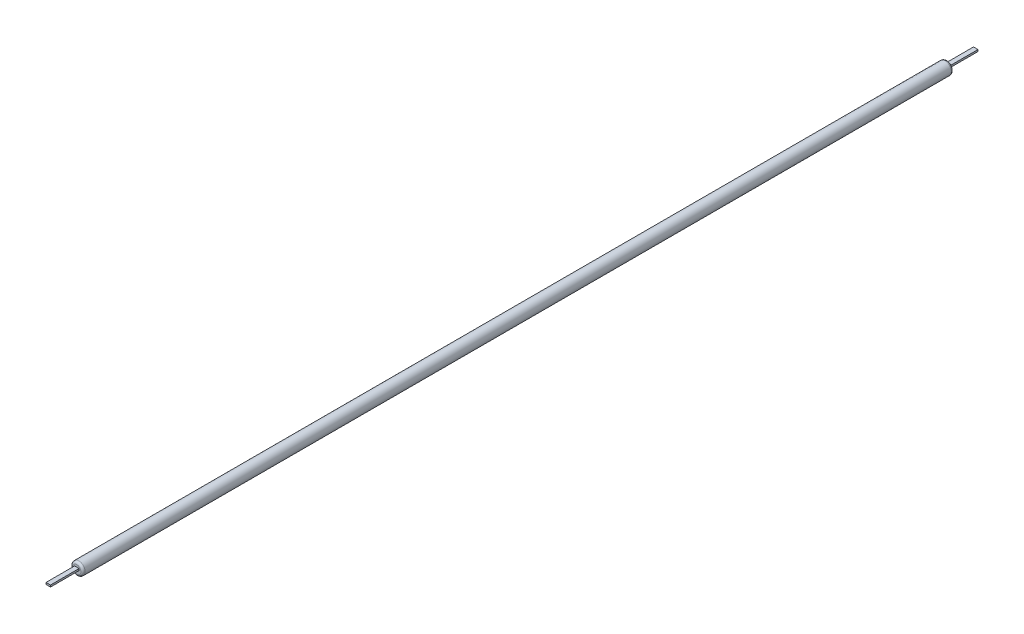
ISO-10303-21;
HEADER;
FILE_DESCRIPTION(('STEP AP214'),'2;1');
FILE_NAME('part.step','',(''),(''),'','','');
FILE_SCHEMA(('AUTOMOTIVE_DESIGN { 1 0 10303 214 1 1 1 1 }'));
ENDSEC;
DATA;
#1=APPLICATION_CONTEXT('core data for automotive mechanical design processes');
#2=APPLICATION_PROTOCOL_DEFINITION('international standard','automotive_design',2000,#1);
#3=PRODUCT_CONTEXT('',#1,'mechanical');
#4=PRODUCT('Part','Part','',(#3));
#5=PRODUCT_RELATED_PRODUCT_CATEGORY('part','',(#4));
#6=PRODUCT_DEFINITION_FORMATION('','',#4);
#7=PRODUCT_DEFINITION_CONTEXT('part definition',#1,'design');
#8=PRODUCT_DEFINITION('design','',#6,#7);
#9=PRODUCT_DEFINITION_SHAPE('','',#8);
#10=(LENGTH_UNIT() NAMED_UNIT(*) SI_UNIT(.MILLI.,.METRE.));
#11=(NAMED_UNIT(*) PLANE_ANGLE_UNIT() SI_UNIT($,.RADIAN.));
#12=(NAMED_UNIT(*) SI_UNIT($,.STERADIAN.) SOLID_ANGLE_UNIT());
#13=UNCERTAINTY_MEASURE_WITH_UNIT(LENGTH_MEASURE(1.E-05),#10,'distance_accuracy_value','');
#14=(GEOMETRIC_REPRESENTATION_CONTEXT(3) GLOBAL_UNCERTAINTY_ASSIGNED_CONTEXT((#13)) GLOBAL_UNIT_ASSIGNED_CONTEXT((#10,
#11,#12)) REPRESENTATION_CONTEXT('',''));
#15=CARTESIAN_POINT('',(0.,0.,0.));
#16=DIRECTION('',(0.,0.,1.));
#17=DIRECTION('',(1.,0.,0.));
#18=AXIS2_PLACEMENT_3D('',#15,#16,#17);
#19=CARTESIAN_POINT('',(0.,0.,0.));
#20=DIRECTION('',(0.,-1.,0.));
#21=DIRECTION('',(0.,0.,-1.));
#22=AXIS2_PLACEMENT_3D('',#19,#20,#21);
#23=PLANE('',#22);
#24=DIRECTION('',(1.,0.,0.));
#25=VECTOR('',#24,1.);
#26=CARTESIAN_POINT('',(0.,0.,0.));
#27=LINE('',#26,#25);
#28=CARTESIAN_POINT('',(-0.314851495323452,0.,0.));
#29=VERTEX_POINT('',#28);
#30=CARTESIAN_POINT('',(0.314851495323452,0.,0.));
#31=VERTEX_POINT('',#30);
#32=EDGE_CURVE('E454',#29,#31,#27,.T.);
#33=ORIENTED_EDGE('',*,*,#32,.F.);
#34=DIRECTION('',(0.,0.,1.));
#35=VECTOR('',#34,1.);
#36=CARTESIAN_POINT('',(-0.314851495323452,0.,4.));
#37=LINE('',#36,#35);
#38=CARTESIAN_POINT('',(-0.314851495323452,0.,-4.));
#39=VERTEX_POINT('',#38);
#40=EDGE_CURVE('E224',#39,#29,#37,.T.);
#41=ORIENTED_EDGE('',*,*,#40,.F.);
#42=DIRECTION('',(-1.,0.,0.));
#43=VECTOR('',#42,1.);
#44=CARTESIAN_POINT('',(-0.314851495323452,0.,-4.));
#45=LINE('',#44,#43);
#46=CARTESIAN_POINT('',(0.314851495323452,0.,-4.));
#47=VERTEX_POINT('',#46);
#48=EDGE_CURVE('E232',#47,#39,#45,.T.);
#49=ORIENTED_EDGE('',*,*,#48,.F.);
#50=DIRECTION('',(0.,0.,-1.));
#51=VECTOR('',#50,1.);
#52=CARTESIAN_POINT('',(0.314851495323452,0.,4.));
#53=LINE('',#52,#51);
#54=EDGE_CURVE('E220',#31,#47,#53,.T.);
#55=ORIENTED_EDGE('',*,*,#54,.F.);
#56=EDGE_LOOP('',(#33,#41,#49,#55));
#57=FACE_BOUND('',#56,.T.);
#58=DIRECTION('',(0.,0.,1.));
#59=VECTOR('',#58,1.);
#60=CARTESIAN_POINT('',(-0.17116827667545,0.,-3.03330056295761));
#61=LINE('',#60,#59);
#62=CARTESIAN_POINT('',(-0.17116827667545,0.,-3.03330056295761));
#63=VERTEX_POINT('',#62);
#64=CARTESIAN_POINT('',(-0.17116827667545,0.,-2.98842876808582));
#65=VERTEX_POINT('',#64);
#66=EDGE_CURVE('E190',#63,#65,#61,.T.);
#67=ORIENTED_EDGE('',*,*,#66,.T.);
#68=DIRECTION('',(1.,0.,0.));
#69=VECTOR('',#68,1.);
#70=CARTESIAN_POINT('',(-0.17116827667545,0.,-2.98842876808582));
#71=LINE('',#70,#69);
#72=CARTESIAN_POINT('',(-0.0237323792395522,0.,-2.98842876808582));
#73=VERTEX_POINT('',#72);
#74=EDGE_CURVE('E52',#65,#73,#71,.T.);
#75=ORIENTED_EDGE('',*,*,#74,.T.);
#76=DIRECTION('',(0.,0.,1.));
#77=VECTOR('',#76,1.);
#78=CARTESIAN_POINT('',(-0.0237323792395522,0.,-2.98842876808582));
#79=LINE('',#78,#77);
#80=CARTESIAN_POINT('',(-0.0237323792395522,0.,-2.84099287064992));
#81=VERTEX_POINT('',#80);
#82=EDGE_CURVE('E194',#73,#81,#79,.T.);
#83=ORIENTED_EDGE('',*,*,#82,.T.);
#84=DIRECTION('',(1.,0.,0.));
#85=VECTOR('',#84,1.);
#86=CARTESIAN_POINT('',(-0.0237323792395522,0.,-2.84099287064992));
#87=LINE('',#86,#85);
#88=CARTESIAN_POINT('',(0.0211394156322427,0.,-2.84099287064992));
#89=VERTEX_POINT('',#88);
#90=EDGE_CURVE('E272',#81,#89,#87,.T.);
#91=ORIENTED_EDGE('',*,*,#90,.T.);
#92=DIRECTION('',(0.,0.,-1.));
#93=VECTOR('',#92,1.);
#94=CARTESIAN_POINT('',(0.0211394156322427,0.,-2.84099287064992));
#95=LINE('',#94,#93);
#96=CARTESIAN_POINT('',(0.0211394156322427,0.,-2.98842876808582));
#97=VERTEX_POINT('',#96);
#98=EDGE_CURVE('E275',#89,#97,#95,.T.);
#99=ORIENTED_EDGE('',*,*,#98,.T.);
#100=DIRECTION('',(1.,0.,0.));
#101=VECTOR('',#100,1.);
#102=CARTESIAN_POINT('',(0.0211394156322427,0.,-2.98842876808582));
#103=LINE('',#102,#101);
#104=CARTESIAN_POINT('',(0.16857531306814,0.,-2.98842876808582));
#105=VERTEX_POINT('',#104);
#106=EDGE_CURVE('E281',#97,#105,#103,.T.);
#107=ORIENTED_EDGE('',*,*,#106,.T.);
#108=DIRECTION('',(0.,0.,-1.));
#109=VECTOR('',#108,1.);
#110=CARTESIAN_POINT('',(0.16857531306814,0.,-2.98842876808582));
#111=LINE('',#110,#109);
#112=CARTESIAN_POINT('',(0.16857531306814,0.,-3.03330056295761));
#113=VERTEX_POINT('',#112);
#114=EDGE_CURVE('E296',#105,#113,#111,.T.);
#115=ORIENTED_EDGE('',*,*,#114,.T.);
#116=DIRECTION('',(-1.,0.,0.));
#117=VECTOR('',#116,1.);
#118=CARTESIAN_POINT('',(0.16857531306814,0.,-3.03330056295761));
#119=LINE('',#118,#117);
#120=CARTESIAN_POINT('',(0.0211394156322427,0.,-3.03330056295761));
#121=VERTEX_POINT('',#120);
#122=EDGE_CURVE('E300',#113,#121,#119,.T.);
#123=ORIENTED_EDGE('',*,*,#122,.T.);
#124=DIRECTION('',(0.,0.,-1.));
#125=VECTOR('',#124,1.);
#126=CARTESIAN_POINT('',(0.0211394156322427,0.,-3.03330056295761));
#127=LINE('',#126,#125);
#128=CARTESIAN_POINT('',(0.0211394156322427,0.,-3.18073646039351));
#129=VERTEX_POINT('',#128);
#130=EDGE_CURVE('E304',#121,#129,#127,.T.);
#131=ORIENTED_EDGE('',*,*,#130,.T.);
#132=DIRECTION('',(-1.,0.,0.));
#133=VECTOR('',#132,1.);
#134=CARTESIAN_POINT('',(0.0211394156322427,0.,-3.18073646039351));
#135=LINE('',#134,#133);
#136=CARTESIAN_POINT('',(-0.0237323792395522,0.,-3.18073646039351));
#137=VERTEX_POINT('',#136);
#138=EDGE_CURVE('E309',#129,#137,#135,.T.);
#139=ORIENTED_EDGE('',*,*,#138,.T.);
#140=DIRECTION('',(0.,0.,1.));
#141=VECTOR('',#140,1.);
#142=CARTESIAN_POINT('',(-0.0237323792395522,0.,-3.18073646039351));
#143=LINE('',#142,#141);
#144=CARTESIAN_POINT('',(-0.0237323792395522,0.,-3.03330056295761));
#145=VERTEX_POINT('',#144);
#146=EDGE_CURVE('E312',#137,#145,#143,.T.);
#147=ORIENTED_EDGE('',*,*,#146,.T.);
#148=DIRECTION('',(-1.,0.,0.));
#149=VECTOR('',#148,1.);
#150=CARTESIAN_POINT('',(-0.0237323792395522,0.,-3.03330056295761));
#151=LINE('',#150,#149);
#152=EDGE_CURVE('E246',#145,#63,#151,.T.);
#153=ORIENTED_EDGE('',*,*,#152,.T.);
#154=EDGE_LOOP('',(#67,#75,#83,#91,#99,#107,#115,#123,#131,#139,#147,#153));
#155=FACE_BOUND('',#154,.T.);
#156=ADVANCED_FACE('F37',(#57,#155),#23,.T.);
#157=CARTESIAN_POINT('',(0.,0.,0.));
#158=DIRECTION('',(0.,0.,1.));
#159=DIRECTION('',(1.,0.,0.));
#160=AXIS2_PLACEMENT_3D('',#157,#158,#159);
#161=PLANE('',#160);
#162=CARTESIAN_POINT('',(0.,0.,0.));
#163=DIRECTION('',(0.,0.,1.));
#164=DIRECTION('',(1.,0.,0.));
#165=AXIS2_PLACEMENT_3D('',#162,#163,#164);
#166=CIRCLE('',#165,0.575);
#167=CARTESIAN_POINT('',(0.575,0.,0.));
#168=VERTEX_POINT('',#167);
#169=EDGE_CURVE('E45',#168,#168,#166,.F.);
#170=ORIENTED_EDGE('',*,*,#169,.T.);
#171=EDGE_LOOP('',(#170));
#172=FACE_BOUND('',#171,.T.);
#173=DIRECTION('',(1.,0.,0.));
#174=VECTOR('',#173,1.);
#175=CARTESIAN_POINT('',(0.,0.25,0.));
#176=LINE('',#175,#174);
#177=CARTESIAN_POINT('',(-0.314851495323452,0.25,0.));
#178=VERTEX_POINT('',#177);
#179=CARTESIAN_POINT('',(0.314851495323452,0.25,0.));
#180=VERTEX_POINT('',#179);
#181=EDGE_CURVE('E447',#178,#180,#176,.T.);
#182=ORIENTED_EDGE('',*,*,#181,.F.);
#183=DIRECTION('',(0.,1.,0.));
#184=VECTOR('',#183,1.);
#185=CARTESIAN_POINT('',(-0.314851495323452,0.,0.));
#186=LINE('',#185,#184);
#187=EDGE_CURVE('E452',#29,#178,#186,.T.);
#188=ORIENTED_EDGE('',*,*,#187,.F.);
#189=ORIENTED_EDGE('',*,*,#32,.T.);
#190=DIRECTION('',(0.,-1.,0.));
#191=VECTOR('',#190,1.);
#192=CARTESIAN_POINT('',(0.314851495323452,0.,0.));
#193=LINE('',#192,#191);
#194=EDGE_CURVE('E449',#180,#31,#193,.T.);
#195=ORIENTED_EDGE('',*,*,#194,.F.);
#196=EDGE_LOOP('',(#182,#188,#189,#195));
#197=FACE_BOUND('',#196,.T.);
#198=ADVANCED_FACE('F382',(#172,#197),#161,.F.);
#199=CARTESIAN_POINT('',(0.,0.,122.));
#200=DIRECTION('',(0.,0.,-1.));
#201=DIRECTION('',(-1.,0.,0.));
#202=AXIS2_PLACEMENT_3D('',#199,#200,#201);
#203=CYLINDRICAL_SURFACE('',#202,0.875);
#204=CARTESIAN_POINT('',(0.,0.,0.299999999999981));
#205=DIRECTION('',(0.,0.,1.));
#206=DIRECTION('',(1.,0.,0.));
#207=AXIS2_PLACEMENT_3D('',#204,#205,#206);
#208=CIRCLE('',#207,0.875);
#209=CARTESIAN_POINT('',(0.875,0.,0.299999999999981));
#210=VERTEX_POINT('',#209);
#211=EDGE_CURVE('E430',#210,#210,#208,.T.);
#212=ORIENTED_EDGE('',*,*,#211,.T.);
#213=EDGE_LOOP('',(#212));
#214=FACE_BOUND('',#213,.T.);
#215=CARTESIAN_POINT('',(0.,0.,121.7));
#216=DIRECTION('',(0.,0.,1.));
#217=DIRECTION('',(1.,0.,0.));
#218=AXIS2_PLACEMENT_3D('',#215,#216,#217);
#219=CIRCLE('',#218,0.875);
#220=CARTESIAN_POINT('',(0.875,0.,121.7));
#221=VERTEX_POINT('',#220);
#222=EDGE_CURVE('E431',#221,#221,#219,.F.);
#223=ORIENTED_EDGE('',*,*,#222,.T.);
#224=EDGE_LOOP('',(#223));
#225=FACE_BOUND('',#224,.T.);
#226=ADVANCED_FACE('F388',(#214,#225),#203,.T.);
#227=CARTESIAN_POINT('',(0.,0.,122.));
#228=DIRECTION('',(0.,0.,1.));
#229=DIRECTION('',(1.,0.,0.));
#230=AXIS2_PLACEMENT_3D('',#227,#228,#229);
#231=PLANE('',#230);
#232=CARTESIAN_POINT('',(0.,0.,122.));
#233=DIRECTION('',(0.,0.,1.));
#234=DIRECTION('',(1.,0.,0.));
#235=AXIS2_PLACEMENT_3D('',#232,#233,#234);
#236=CIRCLE('',#235,0.575);
#237=CARTESIAN_POINT('',(0.575,0.,122.));
#238=VERTEX_POINT('',#237);
#239=EDGE_CURVE('E12',#238,#238,#236,.T.);
#240=ORIENTED_EDGE('',*,*,#239,.T.);
#241=EDGE_LOOP('',(#240));
#242=FACE_BOUND('',#241,.T.);
#243=DIRECTION('',(-1.,0.,0.));
#244=VECTOR('',#243,1.);
#245=CARTESIAN_POINT('',(0.,0.25,122.));
#246=LINE('',#245,#244);
#247=CARTESIAN_POINT('',(0.314851495323457,0.25,122.));
#248=VERTEX_POINT('',#247);
#249=CARTESIAN_POINT('',(-0.314851495323447,0.25,122.));
#250=VERTEX_POINT('',#249);
#251=EDGE_CURVE('E434',#248,#250,#246,.T.);
#252=ORIENTED_EDGE('',*,*,#251,.F.);
#253=DIRECTION('',(0.,-1.,0.));
#254=VECTOR('',#253,1.);
#255=CARTESIAN_POINT('',(0.314851495323457,0.,122.));
#256=LINE('',#255,#254);
#257=CARTESIAN_POINT('',(0.314851495323457,0.,122.));
#258=VERTEX_POINT('',#257);
#259=EDGE_CURVE('E438',#248,#258,#256,.T.);
#260=ORIENTED_EDGE('',*,*,#259,.T.);
#261=DIRECTION('',(-1.,0.,0.));
#262=VECTOR('',#261,1.);
#263=CARTESIAN_POINT('',(0.,0.,122.));
#264=LINE('',#263,#262);
#265=CARTESIAN_POINT('',(-0.314851495323448,0.,122.));
#266=VERTEX_POINT('',#265);
#267=EDGE_CURVE('E444',#258,#266,#264,.T.);
#268=ORIENTED_EDGE('',*,*,#267,.T.);
#269=DIRECTION('',(0.,1.,0.));
#270=VECTOR('',#269,1.);
#271=CARTESIAN_POINT('',(-0.314851495323447,0.,122.));
#272=LINE('',#271,#270);
#273=EDGE_CURVE('E441',#266,#250,#272,.T.);
#274=ORIENTED_EDGE('',*,*,#273,.T.);
#275=EDGE_LOOP('',(#252,#260,#268,#274));
#276=FACE_BOUND('',#275,.T.);
#277=ADVANCED_FACE('F407',(#242,#276),#231,.T.);
#278=CARTESIAN_POINT('',(0.314851495323452,0.25,4.));
#279=DIRECTION('',(-1.,0.,0.));
#280=DIRECTION('',(0.,0.,1.));
#281=AXIS2_PLACEMENT_3D('',#278,#279,#280);
#282=PLANE('',#281);
#283=DIRECTION('',(0.,0.,-1.));
#284=VECTOR('',#283,1.);
#285=CARTESIAN_POINT('',(0.314851495323452,0.25,4.));
#286=LINE('',#285,#284);
#287=CARTESIAN_POINT('',(0.314851495323452,0.25,-4.));
#288=VERTEX_POINT('',#287);
#289=EDGE_CURVE('E221',#180,#288,#286,.T.);
#290=ORIENTED_EDGE('',*,*,#289,.F.);
#291=ORIENTED_EDGE('',*,*,#194,.T.);
#292=ORIENTED_EDGE('',*,*,#54,.T.);
#293=DIRECTION('',(0.,-1.,0.));
#294=VECTOR('',#293,1.);
#295=CARTESIAN_POINT('',(0.314851495323452,0.25,-4.));
#296=LINE('',#295,#294);
#297=EDGE_CURVE('E458',#288,#47,#296,.T.);
#298=ORIENTED_EDGE('',*,*,#297,.F.);
#299=EDGE_LOOP('',(#290,#291,#292,#298));
#300=FACE_BOUND('',#299,.T.);
#301=ADVANCED_FACE('F398',(#300),#282,.F.);
#302=CARTESIAN_POINT('',(-0.314851495323452,0.25,4.));
#303=DIRECTION('',(1.,0.,0.));
#304=DIRECTION('',(0.,0.,-1.));
#305=AXIS2_PLACEMENT_3D('',#302,#303,#304);
#306=PLANE('',#305);
#307=ORIENTED_EDGE('',*,*,#40,.T.);
#308=ORIENTED_EDGE('',*,*,#187,.T.);
#309=DIRECTION('',(0.,0.,1.));
#310=VECTOR('',#309,1.);
#311=CARTESIAN_POINT('',(-0.314851495323452,0.25,4.));
#312=LINE('',#311,#310);
#313=CARTESIAN_POINT('',(-0.314851495323452,0.25,-4.));
#314=VERTEX_POINT('',#313);
#315=EDGE_CURVE('E226',#314,#178,#312,.T.);
#316=ORIENTED_EDGE('',*,*,#315,.F.);
#317=DIRECTION('',(0.,-1.,0.));
#318=VECTOR('',#317,1.);
#319=CARTESIAN_POINT('',(-0.314851495323452,0.25,-4.));
#320=LINE('',#319,#318);
#321=EDGE_CURVE('E229',#314,#39,#320,.T.);
#322=ORIENTED_EDGE('',*,*,#321,.T.);
#323=EDGE_LOOP('',(#307,#308,#316,#322));
#324=FACE_BOUND('',#323,.T.);
#325=ADVANCED_FACE('F395',(#324),#306,.F.);
#326=CARTESIAN_POINT('',(0.,0.25,0.));
#327=DIRECTION('',(0.,-1.,0.));
#328=DIRECTION('',(0.,0.,-1.));
#329=AXIS2_PLACEMENT_3D('',#326,#327,#328);
#330=PLANE('',#329);
#331=ORIENTED_EDGE('',*,*,#315,.T.);
#332=ORIENTED_EDGE('',*,*,#181,.T.);
#333=ORIENTED_EDGE('',*,*,#289,.T.);
#334=DIRECTION('',(-1.,0.,0.));
#335=VECTOR('',#334,1.);
#336=CARTESIAN_POINT('',(-0.314851495323452,0.25,-4.));
#337=LINE('',#336,#335);
#338=EDGE_CURVE('E223',#288,#314,#337,.T.);
#339=ORIENTED_EDGE('',*,*,#338,.T.);
#340=EDGE_LOOP('',(#331,#332,#333,#339));
#341=FACE_BOUND('',#340,.T.);
#342=ADVANCED_FACE('F393',(#341),#330,.F.);
#343=CARTESIAN_POINT('',(-0.314851495323452,0.25,-4.));
#344=DIRECTION('',(0.,0.,1.));
#345=DIRECTION('',(1.,0.,0.));
#346=AXIS2_PLACEMENT_3D('',#343,#344,#345);
#347=PLANE('',#346);
#348=ORIENTED_EDGE('',*,*,#48,.T.);
#349=ORIENTED_EDGE('',*,*,#321,.F.);
#350=ORIENTED_EDGE('',*,*,#338,.F.);
#351=ORIENTED_EDGE('',*,*,#297,.T.);
#352=EDGE_LOOP('',(#348,#349,#350,#351));
#353=FACE_BOUND('',#352,.T.);
#354=ADVANCED_FACE('F400',(#353),#347,.F.);
#355=CARTESIAN_POINT('',(0.314851495323457,0.25,118.));
#356=DIRECTION('',(-1.,0.,0.));
#357=DIRECTION('',(0.,0.,1.));
#358=AXIS2_PLACEMENT_3D('',#355,#356,#357);
#359=PLANE('',#358);
#360=ORIENTED_EDGE('',*,*,#259,.F.);
#361=DIRECTION('',(0.,0.,-1.));
#362=VECTOR('',#361,1.);
#363=CARTESIAN_POINT('',(0.314851495323457,0.25,118.));
#364=LINE('',#363,#362);
#365=CARTESIAN_POINT('',(0.314851495323458,0.25,126.));
#366=VERTEX_POINT('',#365);
#367=EDGE_CURVE('E204',#366,#248,#364,.T.);
#368=ORIENTED_EDGE('',*,*,#367,.F.);
#369=DIRECTION('',(0.,-1.,0.));
#370=VECTOR('',#369,1.);
#371=CARTESIAN_POINT('',(0.314851495323458,0.25,126.));
#372=LINE('',#371,#370);
#373=CARTESIAN_POINT('',(0.314851495323458,0.,126.));
#374=VERTEX_POINT('',#373);
#375=EDGE_CURVE('E211',#366,#374,#372,.T.);
#376=ORIENTED_EDGE('',*,*,#375,.T.);
#377=DIRECTION('',(0.,0.,-1.));
#378=VECTOR('',#377,1.);
#379=CARTESIAN_POINT('',(0.314851495323457,0.,118.));
#380=LINE('',#379,#378);
#381=EDGE_CURVE('E195',#374,#258,#380,.T.);
#382=ORIENTED_EDGE('',*,*,#381,.T.);
#383=EDGE_LOOP('',(#360,#368,#376,#382));
#384=FACE_BOUND('',#383,.T.);
#385=ADVANCED_FACE('F403',(#384),#359,.F.);
#386=CARTESIAN_POINT('',(-0.314851495323448,0.25,118.));
#387=DIRECTION('',(1.,0.,0.));
#388=DIRECTION('',(0.,0.,-1.));
#389=AXIS2_PLACEMENT_3D('',#386,#387,#388);
#390=PLANE('',#389);
#391=ORIENTED_EDGE('',*,*,#273,.F.);
#392=DIRECTION('',(0.,0.,1.));
#393=VECTOR('',#392,1.);
#394=CARTESIAN_POINT('',(-0.314851495323448,0.,118.));
#395=LINE('',#394,#393);
#396=CARTESIAN_POINT('',(-0.314851495323447,0.,126.));
#397=VERTEX_POINT('',#396);
#398=EDGE_CURVE('E60',#266,#397,#395,.T.);
#399=ORIENTED_EDGE('',*,*,#398,.T.);
#400=DIRECTION('',(0.,-1.,0.));
#401=VECTOR('',#400,1.);
#402=CARTESIAN_POINT('',(-0.314851495323447,0.25,126.));
#403=LINE('',#402,#401);
#404=CARTESIAN_POINT('',(-0.314851495323447,0.25,126.));
#405=VERTEX_POINT('',#404);
#406=EDGE_CURVE('E217',#405,#397,#403,.T.);
#407=ORIENTED_EDGE('',*,*,#406,.F.);
#408=DIRECTION('',(0.,0.,1.));
#409=VECTOR('',#408,1.);
#410=CARTESIAN_POINT('',(-0.314851495323448,0.25,118.));
#411=LINE('',#410,#409);
#412=EDGE_CURVE('E207',#250,#405,#411,.T.);
#413=ORIENTED_EDGE('',*,*,#412,.F.);
#414=EDGE_LOOP('',(#391,#399,#407,#413));
#415=FACE_BOUND('',#414,.T.);
#416=ADVANCED_FACE('F492',(#415),#390,.F.);
#417=CARTESIAN_POINT('',(-0.314851495323447,0.25,126.));
#418=DIRECTION('',(0.,0.,-1.));
#419=DIRECTION('',(-1.,0.,0.));
#420=AXIS2_PLACEMENT_3D('',#417,#418,#419);
#421=PLANE('',#420);
#422=DIRECTION('',(1.,0.,0.));
#423=VECTOR('',#422,1.);
#424=CARTESIAN_POINT('',(-0.314851495323447,0.,126.));
#425=LINE('',#424,#423);
#426=EDGE_CURVE('E208',#397,#374,#425,.T.);
#427=ORIENTED_EDGE('',*,*,#426,.T.);
#428=ORIENTED_EDGE('',*,*,#375,.F.);
#429=DIRECTION('',(1.,0.,0.));
#430=VECTOR('',#429,1.);
#431=CARTESIAN_POINT('',(-0.314851495323447,0.25,126.));
#432=LINE('',#431,#430);
#433=EDGE_CURVE('E210',#405,#366,#432,.T.);
#434=ORIENTED_EDGE('',*,*,#433,.F.);
#435=ORIENTED_EDGE('',*,*,#406,.T.);
#436=EDGE_LOOP('',(#427,#428,#434,#435));
#437=FACE_BOUND('',#436,.T.);
#438=ADVANCED_FACE('F499',(#437),#421,.F.);
#439=CARTESIAN_POINT('',(0.,0.25,0.));
#440=DIRECTION('',(0.,1.,0.));
#441=DIRECTION('',(0.,0.,1.));
#442=AXIS2_PLACEMENT_3D('',#439,#440,#441);
#443=PLANE('',#442);
#444=ORIENTED_EDGE('',*,*,#367,.T.);
#445=ORIENTED_EDGE('',*,*,#251,.T.);
#446=ORIENTED_EDGE('',*,*,#412,.T.);
#447=ORIENTED_EDGE('',*,*,#433,.T.);
#448=EDGE_LOOP('',(#444,#445,#446,#447));
#449=FACE_BOUND('',#448,.T.);
#450=ADVANCED_FACE('F423',(#449),#443,.T.);
#451=CARTESIAN_POINT('',(0.,0.,0.));
#452=DIRECTION('',(0.,1.,0.));
#453=DIRECTION('',(0.,0.,1.));
#454=AXIS2_PLACEMENT_3D('',#451,#452,#453);
#455=PLANE('',#454);
#456=ORIENTED_EDGE('',*,*,#267,.F.);
#457=ORIENTED_EDGE('',*,*,#381,.F.);
#458=ORIENTED_EDGE('',*,*,#426,.F.);
#459=ORIENTED_EDGE('',*,*,#398,.F.);
#460=EDGE_LOOP('',(#456,#457,#458,#459));
#461=FACE_BOUND('',#460,.T.);
#462=ADVANCED_FACE('F416',(#461),#455,.F.);
#463=CARTESIAN_POINT('',(0.,0.,0.299999999999995));
#464=DIRECTION('',(0.,0.,1.));
#465=DIRECTION('',(1.,0.,0.));
#466=AXIS2_PLACEMENT_3D('',#463,#464,#465);
#467=TOROIDAL_SURFACE('',#466,0.575,0.3);
#468=ORIENTED_EDGE('',*,*,#169,.F.);
#469=EDGE_LOOP('',(#468));
#470=FACE_BOUND('',#469,.T.);
#471=ORIENTED_EDGE('',*,*,#211,.F.);
#472=EDGE_LOOP('',(#471));
#473=FACE_BOUND('',#472,.T.);
#474=ADVANCED_FACE('F414',(#470,#473),#467,.T.);
#475=CARTESIAN_POINT('',(0.,0.,121.7));
#476=DIRECTION('',(0.,0.,1.));
#477=DIRECTION('',(1.,0.,0.));
#478=AXIS2_PLACEMENT_3D('',#475,#476,#477);
#479=TOROIDAL_SURFACE('',#478,0.575,0.3);
#480=ORIENTED_EDGE('',*,*,#222,.F.);
#481=EDGE_LOOP('',(#480));
#482=FACE_BOUND('',#481,.T.);
#483=ORIENTED_EDGE('',*,*,#239,.F.);
#484=EDGE_LOOP('',(#483));
#485=FACE_BOUND('',#484,.T.);
#486=ADVANCED_FACE('F39',(#482,#485),#479,.T.);
#487=CARTESIAN_POINT('',(-0.17116827667545,0.06,-2.98842876808582));
#488=DIRECTION('',(0.,0.,-1.));
#489=DIRECTION('',(-1.,0.,0.));
#490=AXIS2_PLACEMENT_3D('',#487,#488,#489);
#491=PLANE('',#490);
#492=ORIENTED_EDGE('',*,*,#74,.F.);
#493=DIRECTION('',(0.,-1.,0.));
#494=VECTOR('',#493,1.);
#495=CARTESIAN_POINT('',(-0.17116827667545,0.06,-2.98842876808582));
#496=LINE('',#495,#494);
#497=CARTESIAN_POINT('',(-0.17116827667545,0.06,-2.98842876808582));
#498=VERTEX_POINT('',#497);
#499=EDGE_CURVE('E189',#498,#65,#496,.T.);
#500=ORIENTED_EDGE('',*,*,#499,.F.);
#501=DIRECTION('',(1.,0.,0.));
#502=VECTOR('',#501,1.);
#503=CARTESIAN_POINT('',(-0.17116827667545,0.06,-2.98842876808582));
#504=LINE('',#503,#502);
#505=CARTESIAN_POINT('',(-0.0237323792395522,0.06,-2.98842876808582));
#506=VERTEX_POINT('',#505);
#507=EDGE_CURVE('E180',#498,#506,#504,.T.);
#508=ORIENTED_EDGE('',*,*,#507,.T.);
#509=DIRECTION('',(0.,-1.,0.));
#510=VECTOR('',#509,1.);
#511=CARTESIAN_POINT('',(-0.0237323792395522,0.06,-2.98842876808582));
#512=LINE('',#511,#510);
#513=EDGE_CURVE('E188',#506,#73,#512,.T.);
#514=ORIENTED_EDGE('',*,*,#513,.T.);
#515=EDGE_LOOP('',(#492,#500,#508,#514));
#516=FACE_BOUND('',#515,.T.);
#517=ADVANCED_FACE('F187',(#516),#491,.T.);
#518=CARTESIAN_POINT('',(-0.0237323792395522,0.06,-2.98842876808582));
#519=DIRECTION('',(1.,0.,0.));
#520=DIRECTION('',(0.,0.,-1.));
#521=AXIS2_PLACEMENT_3D('',#518,#519,#520);
#522=PLANE('',#521);
#523=ORIENTED_EDGE('',*,*,#82,.F.);
#524=ORIENTED_EDGE('',*,*,#513,.F.);
#525=DIRECTION('',(0.,0.,1.));
#526=VECTOR('',#525,1.);
#527=CARTESIAN_POINT('',(-0.0237323792395522,0.06,-2.98842876808582));
#528=LINE('',#527,#526);
#529=CARTESIAN_POINT('',(-0.0237323792395522,0.06,-2.84099287064992));
#530=VERTEX_POINT('',#529);
#531=EDGE_CURVE('E176',#506,#530,#528,.T.);
#532=ORIENTED_EDGE('',*,*,#531,.T.);
#533=DIRECTION('',(0.,-1.,0.));
#534=VECTOR('',#533,1.);
#535=CARTESIAN_POINT('',(-0.0237323792395522,0.06,-2.84099287064992));
#536=LINE('',#535,#534);
#537=EDGE_CURVE('E196',#530,#81,#536,.T.);
#538=ORIENTED_EDGE('',*,*,#537,.T.);
#539=EDGE_LOOP('',(#523,#524,#532,#538));
#540=FACE_BOUND('',#539,.T.);
#541=ADVANCED_FACE('F192',(#540),#522,.T.);
#542=CARTESIAN_POINT('',(-0.0237323792395522,0.06,-2.84099287064992));
#543=DIRECTION('',(0.,0.,-1.));
#544=DIRECTION('',(-1.,0.,0.));
#545=AXIS2_PLACEMENT_3D('',#542,#543,#544);
#546=PLANE('',#545);
#547=ORIENTED_EDGE('',*,*,#90,.F.);
#548=ORIENTED_EDGE('',*,*,#537,.F.);
#549=DIRECTION('',(1.,0.,0.));
#550=VECTOR('',#549,1.);
#551=CARTESIAN_POINT('',(-0.0237323792395522,0.06,-2.84099287064992));
#552=LINE('',#551,#550);
#553=CARTESIAN_POINT('',(0.0211394156322427,0.06,-2.84099287064992));
#554=VERTEX_POINT('',#553);
#555=EDGE_CURVE('E182',#530,#554,#552,.T.);
#556=ORIENTED_EDGE('',*,*,#555,.T.);
#557=DIRECTION('',(0.,-1.,0.));
#558=VECTOR('',#557,1.);
#559=CARTESIAN_POINT('',(0.0211394156322427,0.06,-2.84099287064992));
#560=LINE('',#559,#558);
#561=EDGE_CURVE('E200',#554,#89,#560,.T.);
#562=ORIENTED_EDGE('',*,*,#561,.T.);
#563=EDGE_LOOP('',(#547,#548,#556,#562));
#564=FACE_BOUND('',#563,.T.);
#565=ADVANCED_FACE('F270',(#564),#546,.T.);
#566=CARTESIAN_POINT('',(0.0211394156322427,0.06,-2.84099287064992));
#567=DIRECTION('',(-1.,0.,0.));
#568=DIRECTION('',(0.,0.,1.));
#569=AXIS2_PLACEMENT_3D('',#566,#567,#568);
#570=PLANE('',#569);
#571=ORIENTED_EDGE('',*,*,#98,.F.);
#572=ORIENTED_EDGE('',*,*,#561,.F.);
#573=DIRECTION('',(0.,0.,-1.));
#574=VECTOR('',#573,1.);
#575=CARTESIAN_POINT('',(0.0211394156322427,0.06,-2.84099287064992));
#576=LINE('',#575,#574);
#577=CARTESIAN_POINT('',(0.0211394156322427,0.06,-2.98842876808582));
#578=VERTEX_POINT('',#577);
#579=EDGE_CURVE('E343',#554,#578,#576,.T.);
#580=ORIENTED_EDGE('',*,*,#579,.T.);
#581=DIRECTION('',(0.,-1.,0.));
#582=VECTOR('',#581,1.);
#583=CARTESIAN_POINT('',(0.0211394156322427,0.06,-2.98842876808582));
#584=LINE('',#583,#582);
#585=EDGE_CURVE('E265',#578,#97,#584,.T.);
#586=ORIENTED_EDGE('',*,*,#585,.T.);
#587=EDGE_LOOP('',(#571,#572,#580,#586));
#588=FACE_BOUND('',#587,.T.);
#589=ADVANCED_FACE('F276',(#588),#570,.T.);
#590=CARTESIAN_POINT('',(0.0211394156322427,0.06,-2.98842876808582));
#591=DIRECTION('',(0.,0.,-1.));
#592=DIRECTION('',(-1.,0.,0.));
#593=AXIS2_PLACEMENT_3D('',#590,#591,#592);
#594=PLANE('',#593);
#595=ORIENTED_EDGE('',*,*,#106,.F.);
#596=ORIENTED_EDGE('',*,*,#585,.F.);
#597=DIRECTION('',(1.,0.,0.));
#598=VECTOR('',#597,1.);
#599=CARTESIAN_POINT('',(0.0211394156322427,0.06,-2.98842876808582));
#600=LINE('',#599,#598);
#601=CARTESIAN_POINT('',(0.16857531306814,0.06,-2.98842876808582));
#602=VERTEX_POINT('',#601);
#603=EDGE_CURVE('E341',#578,#602,#600,.T.);
#604=ORIENTED_EDGE('',*,*,#603,.T.);
#605=DIRECTION('',(0.,-1.,0.));
#606=VECTOR('',#605,1.);
#607=CARTESIAN_POINT('',(0.16857531306814,0.06,-2.98842876808582));
#608=LINE('',#607,#606);
#609=EDGE_CURVE('E263',#602,#105,#608,.T.);
#610=ORIENTED_EDGE('',*,*,#609,.T.);
#611=EDGE_LOOP('',(#595,#596,#604,#610));
#612=FACE_BOUND('',#611,.T.);
#613=ADVANCED_FACE('F347',(#612),#594,.T.);
#614=CARTESIAN_POINT('',(0.16857531306814,0.06,-2.98842876808582));
#615=DIRECTION('',(-1.,0.,0.));
#616=DIRECTION('',(0.,0.,1.));
#617=AXIS2_PLACEMENT_3D('',#614,#615,#616);
#618=PLANE('',#617);
#619=ORIENTED_EDGE('',*,*,#114,.F.);
#620=ORIENTED_EDGE('',*,*,#609,.F.);
#621=DIRECTION('',(0.,0.,-1.));
#622=VECTOR('',#621,1.);
#623=CARTESIAN_POINT('',(0.16857531306814,0.06,-2.98842876808582));
#624=LINE('',#623,#622);
#625=CARTESIAN_POINT('',(0.16857531306814,0.06,-3.03330056295761));
#626=VERTEX_POINT('',#625);
#627=EDGE_CURVE('E339',#602,#626,#624,.T.);
#628=ORIENTED_EDGE('',*,*,#627,.T.);
#629=DIRECTION('',(0.,-1.,0.));
#630=VECTOR('',#629,1.);
#631=CARTESIAN_POINT('',(0.16857531306814,0.06,-3.03330056295761));
#632=LINE('',#631,#630);
#633=EDGE_CURVE('E261',#626,#113,#632,.T.);
#634=ORIENTED_EDGE('',*,*,#633,.T.);
#635=EDGE_LOOP('',(#619,#620,#628,#634));
#636=FACE_BOUND('',#635,.T.);
#637=ADVANCED_FACE('F355',(#636),#618,.T.);
#638=CARTESIAN_POINT('',(0.16857531306814,0.06,-3.03330056295761));
#639=DIRECTION('',(0.,0.,1.));
#640=DIRECTION('',(1.,0.,0.));
#641=AXIS2_PLACEMENT_3D('',#638,#639,#640);
#642=PLANE('',#641);
#643=ORIENTED_EDGE('',*,*,#122,.F.);
#644=ORIENTED_EDGE('',*,*,#633,.F.);
#645=DIRECTION('',(-1.,0.,0.));
#646=VECTOR('',#645,1.);
#647=CARTESIAN_POINT('',(0.16857531306814,0.06,-3.03330056295761));
#648=LINE('',#647,#646);
#649=CARTESIAN_POINT('',(0.0211394156322427,0.06,-3.03330056295761));
#650=VERTEX_POINT('',#649);
#651=EDGE_CURVE('E337',#626,#650,#648,.T.);
#652=ORIENTED_EDGE('',*,*,#651,.T.);
#653=DIRECTION('',(0.,-1.,0.));
#654=VECTOR('',#653,1.);
#655=CARTESIAN_POINT('',(0.0211394156322427,0.06,-3.03330056295761));
#656=LINE('',#655,#654);
#657=EDGE_CURVE('E259',#650,#121,#656,.T.);
#658=ORIENTED_EDGE('',*,*,#657,.T.);
#659=EDGE_LOOP('',(#643,#644,#652,#658));
#660=FACE_BOUND('',#659,.T.);
#661=ADVANCED_FACE('F358',(#660),#642,.T.);
#662=CARTESIAN_POINT('',(0.0211394156322427,0.06,-3.03330056295761));
#663=DIRECTION('',(-1.,0.,0.));
#664=DIRECTION('',(0.,0.,1.));
#665=AXIS2_PLACEMENT_3D('',#662,#663,#664);
#666=PLANE('',#665);
#667=ORIENTED_EDGE('',*,*,#130,.F.);
#668=ORIENTED_EDGE('',*,*,#657,.F.);
#669=DIRECTION('',(0.,0.,-1.));
#670=VECTOR('',#669,1.);
#671=CARTESIAN_POINT('',(0.0211394156322427,0.06,-3.03330056295761));
#672=LINE('',#671,#670);
#673=CARTESIAN_POINT('',(0.0211394156322427,0.06,-3.18073646039351));
#674=VERTEX_POINT('',#673);
#675=EDGE_CURVE('E335',#650,#674,#672,.T.);
#676=ORIENTED_EDGE('',*,*,#675,.T.);
#677=DIRECTION('',(0.,-1.,0.));
#678=VECTOR('',#677,1.);
#679=CARTESIAN_POINT('',(0.0211394156322427,0.06,-3.18073646039351));
#680=LINE('',#679,#678);
#681=EDGE_CURVE('E257',#674,#129,#680,.T.);
#682=ORIENTED_EDGE('',*,*,#681,.T.);
#683=EDGE_LOOP('',(#667,#668,#676,#682));
#684=FACE_BOUND('',#683,.T.);
#685=ADVANCED_FACE('F364',(#684),#666,.T.);
#686=CARTESIAN_POINT('',(0.0211394156322427,0.06,-3.18073646039351));
#687=DIRECTION('',(0.,0.,1.));
#688=DIRECTION('',(1.,0.,0.));
#689=AXIS2_PLACEMENT_3D('',#686,#687,#688);
#690=PLANE('',#689);
#691=ORIENTED_EDGE('',*,*,#138,.F.);
#692=ORIENTED_EDGE('',*,*,#681,.F.);
#693=DIRECTION('',(-1.,0.,0.));
#694=VECTOR('',#693,1.);
#695=CARTESIAN_POINT('',(0.0211394156322427,0.06,-3.18073646039351));
#696=LINE('',#695,#694);
#697=CARTESIAN_POINT('',(-0.0237323792395522,0.06,-3.18073646039351));
#698=VERTEX_POINT('',#697);
#699=EDGE_CURVE('E333',#674,#698,#696,.T.);
#700=ORIENTED_EDGE('',*,*,#699,.T.);
#701=DIRECTION('',(0.,-1.,0.));
#702=VECTOR('',#701,1.);
#703=CARTESIAN_POINT('',(-0.0237323792395522,0.06,-3.18073646039351));
#704=LINE('',#703,#702);
#705=EDGE_CURVE('E255',#698,#137,#704,.T.);
#706=ORIENTED_EDGE('',*,*,#705,.T.);
#707=EDGE_LOOP('',(#691,#692,#700,#706));
#708=FACE_BOUND('',#707,.T.);
#709=ADVANCED_FACE('F368',(#708),#690,.T.);
#710=CARTESIAN_POINT('',(-0.0237323792395522,0.06,-3.18073646039351));
#711=DIRECTION('',(1.,0.,0.));
#712=DIRECTION('',(0.,0.,-1.));
#713=AXIS2_PLACEMENT_3D('',#710,#711,#712);
#714=PLANE('',#713);
#715=ORIENTED_EDGE('',*,*,#146,.F.);
#716=ORIENTED_EDGE('',*,*,#705,.F.);
#717=DIRECTION('',(0.,0.,1.));
#718=VECTOR('',#717,1.);
#719=CARTESIAN_POINT('',(-0.0237323792395522,0.06,-3.18073646039351));
#720=LINE('',#719,#718);
#721=CARTESIAN_POINT('',(-0.0237323792395522,0.06,-3.03330056295761));
#722=VERTEX_POINT('',#721);
#723=EDGE_CURVE('E328',#698,#722,#720,.T.);
#724=ORIENTED_EDGE('',*,*,#723,.T.);
#725=DIRECTION('',(0.,-1.,0.));
#726=VECTOR('',#725,1.);
#727=CARTESIAN_POINT('',(-0.0237323792395522,0.06,-3.03330056295761));
#728=LINE('',#727,#726);
#729=EDGE_CURVE('E253',#722,#145,#728,.T.);
#730=ORIENTED_EDGE('',*,*,#729,.T.);
#731=EDGE_LOOP('',(#715,#716,#724,#730));
#732=FACE_BOUND('',#731,.T.);
#733=ADVANCED_FACE('F372',(#732),#714,.T.);
#734=CARTESIAN_POINT('',(-0.0237323792395522,0.06,-3.03330056295761));
#735=DIRECTION('',(0.,0.,1.));
#736=DIRECTION('',(1.,0.,0.));
#737=AXIS2_PLACEMENT_3D('',#734,#735,#736);
#738=PLANE('',#737);
#739=ORIENTED_EDGE('',*,*,#152,.F.);
#740=ORIENTED_EDGE('',*,*,#729,.F.);
#741=DIRECTION('',(-1.,0.,0.));
#742=VECTOR('',#741,1.);
#743=CARTESIAN_POINT('',(-0.0237323792395522,0.06,-3.03330056295761));
#744=LINE('',#743,#742);
#745=CARTESIAN_POINT('',(-0.17116827667545,0.06,-3.03330056295761));
#746=VERTEX_POINT('',#745);
#747=EDGE_CURVE('E324',#722,#746,#744,.T.);
#748=ORIENTED_EDGE('',*,*,#747,.T.);
#749=DIRECTION('',(0.,-1.,0.));
#750=VECTOR('',#749,1.);
#751=CARTESIAN_POINT('',(-0.17116827667545,0.06,-3.03330056295761));
#752=LINE('',#751,#750);
#753=EDGE_CURVE('E250',#746,#63,#752,.T.);
#754=ORIENTED_EDGE('',*,*,#753,.T.);
#755=EDGE_LOOP('',(#739,#740,#748,#754));
#756=FACE_BOUND('',#755,.T.);
#757=ADVANCED_FACE('F321',(#756),#738,.T.);
#758=CARTESIAN_POINT('',(-0.17116827667545,0.06,-3.03330056295761));
#759=DIRECTION('',(1.,0.,0.));
#760=DIRECTION('',(0.,0.,-1.));
#761=AXIS2_PLACEMENT_3D('',#758,#759,#760);
#762=PLANE('',#761);
#763=ORIENTED_EDGE('',*,*,#66,.F.);
#764=ORIENTED_EDGE('',*,*,#753,.F.);
#765=DIRECTION('',(0.,0.,1.));
#766=VECTOR('',#765,1.);
#767=CARTESIAN_POINT('',(-0.17116827667545,0.06,-3.03330056295761));
#768=LINE('',#767,#766);
#769=EDGE_CURVE('E251',#746,#498,#768,.T.);
#770=ORIENTED_EDGE('',*,*,#769,.T.);
#771=ORIENTED_EDGE('',*,*,#499,.T.);
#772=EDGE_LOOP('',(#763,#764,#770,#771));
#773=FACE_BOUND('',#772,.T.);
#774=ADVANCED_FACE('F326',(#773),#762,.T.);
#775=CARTESIAN_POINT('',(0.,0.06,0.));
#776=DIRECTION('',(0.,-1.,0.));
#777=DIRECTION('',(0.,0.,-1.));
#778=AXIS2_PLACEMENT_3D('',#775,#776,#777);
#779=PLANE('',#778);
#780=ORIENTED_EDGE('',*,*,#507,.F.);
#781=ORIENTED_EDGE('',*,*,#769,.F.);
#782=ORIENTED_EDGE('',*,*,#747,.F.);
#783=ORIENTED_EDGE('',*,*,#723,.F.);
#784=ORIENTED_EDGE('',*,*,#699,.F.);
#785=ORIENTED_EDGE('',*,*,#675,.F.);
#786=ORIENTED_EDGE('',*,*,#651,.F.);
#787=ORIENTED_EDGE('',*,*,#627,.F.);
#788=ORIENTED_EDGE('',*,*,#603,.F.);
#789=ORIENTED_EDGE('',*,*,#579,.F.);
#790=ORIENTED_EDGE('',*,*,#555,.F.);
#791=ORIENTED_EDGE('',*,*,#531,.F.);
#792=EDGE_LOOP('',(#780,#781,#782,#783,#784,#785,#786,#787,#788,#789,#790,#791));
#793=FACE_BOUND('',#792,.T.);
#794=ADVANCED_FACE('F178',(#793),#779,.T.);
#795=CLOSED_SHELL('',(#156,#198,#226,#277,#301,#325,#342,#354,#385,#416,#438,#450,#462,#474,
#486,#517,#541,#565,#589,#613,#637,#661,#685,#709,#733,#757,#774,#794));
#796=MANIFOLD_SOLID_BREP('B2',#795);
#797=ADVANCED_BREP_SHAPE_REPRESENTATION('',(#18,#796),#14);
#798=SHAPE_DEFINITION_REPRESENTATION(#9,#797);
ENDSEC;
END-ISO-10303-21;
